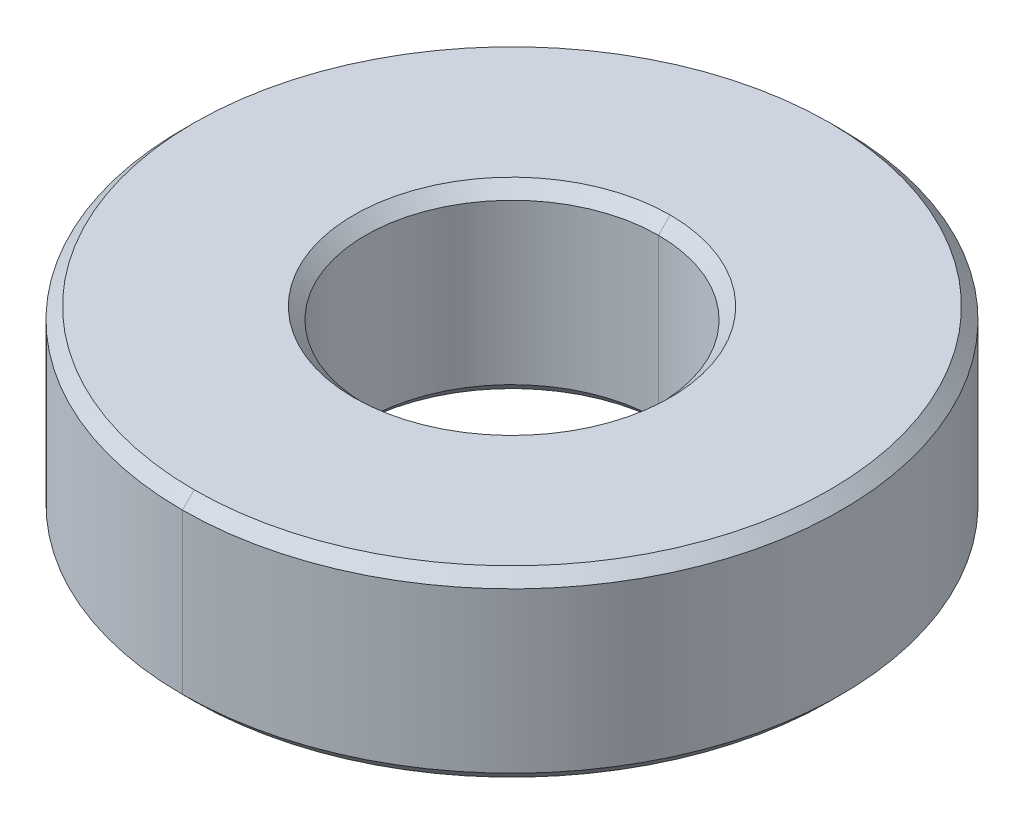
ISO-10303-21;
HEADER;
FILE_DESCRIPTION(('STEP AP214'),'2;1');
FILE_NAME('part.step','',(''),(''),'','','');
FILE_SCHEMA(('AUTOMOTIVE_DESIGN { 1 0 10303 214 1 1 1 1 }'));
ENDSEC;
DATA;
#1=APPLICATION_CONTEXT('core data for automotive mechanical design processes');
#2=APPLICATION_PROTOCOL_DEFINITION('international standard','automotive_design',2000,#1);
#3=PRODUCT_CONTEXT('',#1,'mechanical');
#4=PRODUCT('Part','Part','',(#3));
#5=PRODUCT_RELATED_PRODUCT_CATEGORY('part','',(#4));
#6=PRODUCT_DEFINITION_FORMATION('','',#4);
#7=PRODUCT_DEFINITION_CONTEXT('part definition',#1,'design');
#8=PRODUCT_DEFINITION('design','',#6,#7);
#9=PRODUCT_DEFINITION_SHAPE('','',#8);
#10=(LENGTH_UNIT() NAMED_UNIT(*) SI_UNIT(.MILLI.,.METRE.));
#11=(NAMED_UNIT(*) PLANE_ANGLE_UNIT() SI_UNIT($,.RADIAN.));
#12=(NAMED_UNIT(*) SI_UNIT($,.STERADIAN.) SOLID_ANGLE_UNIT());
#13=UNCERTAINTY_MEASURE_WITH_UNIT(LENGTH_MEASURE(1.E-05),#10,'distance_accuracy_value','');
#14=(GEOMETRIC_REPRESENTATION_CONTEXT(3) GLOBAL_UNCERTAINTY_ASSIGNED_CONTEXT((#13)) GLOBAL_UNIT_ASSIGNED_CONTEXT((#10,
#11,#12)) REPRESENTATION_CONTEXT('',''));
#15=CARTESIAN_POINT('',(0.,0.,0.));
#16=DIRECTION('',(0.,0.,1.));
#17=DIRECTION('',(1.,0.,0.));
#18=AXIS2_PLACEMENT_3D('',#15,#16,#17);
#19=CARTESIAN_POINT('',(0.,3.96875,0.));
#20=DIRECTION('',(0.,-1.,0.));
#21=DIRECTION('',(0.,0.,-1.));
#22=AXIS2_PLACEMENT_3D('',#19,#20,#21);
#23=CONICAL_SURFACE('',#22,13.7795,0.785398163397442);
#24=DIRECTION('',(0.,-0.707106781186552,0.707106781186543));
#25=VECTOR('',#24,1.);
#26=CARTESIAN_POINT('',(0.,3.96875,13.7795));
#27=LINE('',#26,#25);
#28=CARTESIAN_POINT('',(0.,3.96875,13.7795));
#29=VERTEX_POINT('',#28);
#30=CARTESIAN_POINT('',(0.,3.46075,14.2875));
#31=VERTEX_POINT('',#30);
#32=EDGE_CURVE('E125',#29,#31,#27,.T.);
#33=ORIENTED_EDGE('',*,*,#32,.F.);
#34=CARTESIAN_POINT('',(0.,3.96875,0.));
#35=DIRECTION('',(0.,1.,0.));
#36=DIRECTION('',(0.,0.,1.));
#37=AXIS2_PLACEMENT_3D('',#34,#35,#36);
#38=CIRCLE('',#37,13.7795);
#39=CARTESIAN_POINT('',(0.,3.96875,-13.7795));
#40=VERTEX_POINT('',#39);
#41=EDGE_CURVE('E100',#40,#29,#38,.T.);
#42=ORIENTED_EDGE('',*,*,#41,.F.);
#43=DIRECTION('',(0.,-0.707106781186552,-0.707106781186543));
#44=VECTOR('',#43,1.);
#45=CARTESIAN_POINT('',(0.,3.96875,-13.7795));
#46=LINE('',#45,#44);
#47=CARTESIAN_POINT('',(0.,3.46075,-14.2875));
#48=VERTEX_POINT('',#47);
#49=EDGE_CURVE('E141',#40,#48,#46,.T.);
#50=ORIENTED_EDGE('',*,*,#49,.T.);
#51=CARTESIAN_POINT('',(0.,3.46075,0.));
#52=DIRECTION('',(0.,-1.,0.));
#53=DIRECTION('',(0.,0.,1.));
#54=AXIS2_PLACEMENT_3D('',#51,#52,#53);
#55=CIRCLE('',#54,14.2875);
#56=EDGE_CURVE('E153',#31,#48,#55,.T.);
#57=ORIENTED_EDGE('',*,*,#56,.F.);
#58=EDGE_LOOP('',(#33,#42,#50,#57));
#59=FACE_BOUND('',#58,.T.);
#60=ADVANCED_FACE('F16',(#59),#23,.T.);
#61=CARTESIAN_POINT('',(0.,3.46075,0.));
#62=DIRECTION('',(0.,1.,0.));
#63=DIRECTION('',(0.,0.,1.));
#64=AXIS2_PLACEMENT_3D('',#61,#62,#63);
#65=CONICAL_SURFACE('',#64,6.35,0.78539816339745);
#66=DIRECTION('',(0.,0.707106781186546,-0.707106781186549));
#67=VECTOR('',#66,1.);
#68=CARTESIAN_POINT('',(0.,3.46075,-6.35));
#69=LINE('',#68,#67);
#70=CARTESIAN_POINT('',(0.,3.46075,-6.35));
#71=VERTEX_POINT('',#70);
#72=CARTESIAN_POINT('',(0.,3.96875,-6.858));
#73=VERTEX_POINT('',#72);
#74=EDGE_CURVE('E114',#71,#73,#69,.T.);
#75=ORIENTED_EDGE('',*,*,#74,.F.);
#76=CARTESIAN_POINT('',(0.,3.46075,0.));
#77=DIRECTION('',(0.,1.,0.));
#78=DIRECTION('',(0.,0.,1.));
#79=AXIS2_PLACEMENT_3D('',#76,#77,#78);
#80=CIRCLE('',#79,6.35);
#81=CARTESIAN_POINT('',(0.,3.46075,6.35));
#82=VERTEX_POINT('',#81);
#83=EDGE_CURVE('E26',#82,#71,#80,.T.);
#84=ORIENTED_EDGE('',*,*,#83,.F.);
#85=DIRECTION('',(0.,0.707106781186546,0.707106781186549));
#86=VECTOR('',#85,1.);
#87=CARTESIAN_POINT('',(0.,3.46075,6.35));
#88=LINE('',#87,#86);
#89=CARTESIAN_POINT('',(0.,3.96875,6.858));
#90=VERTEX_POINT('',#89);
#91=EDGE_CURVE('E103',#82,#90,#88,.T.);
#92=ORIENTED_EDGE('',*,*,#91,.T.);
#93=CARTESIAN_POINT('',(0.,3.96875,0.));
#94=DIRECTION('',(0.,-1.,0.));
#95=DIRECTION('',(0.,0.,1.));
#96=AXIS2_PLACEMENT_3D('',#93,#94,#95);
#97=CIRCLE('',#96,6.858);
#98=EDGE_CURVE('E89',#73,#90,#97,.T.);
#99=ORIENTED_EDGE('',*,*,#98,.F.);
#100=EDGE_LOOP('',(#75,#84,#92,#99));
#101=FACE_BOUND('',#100,.T.);
#102=ADVANCED_FACE('F104',(#101),#65,.F.);
#103=CARTESIAN_POINT('',(0.,-3.46075,0.));
#104=DIRECTION('',(0.,1.,0.));
#105=DIRECTION('',(0.,0.,1.));
#106=AXIS2_PLACEMENT_3D('',#103,#104,#105);
#107=CONICAL_SURFACE('',#106,14.2875,0.78539816339745);
#108=DIRECTION('',(0.,0.707106781186546,-0.707106781186549));
#109=VECTOR('',#108,1.);
#110=CARTESIAN_POINT('',(0.,-3.46075,-14.2875));
#111=LINE('',#110,#109);
#112=CARTESIAN_POINT('',(0.,-3.96875,-13.7795));
#113=VERTEX_POINT('',#112);
#114=CARTESIAN_POINT('',(0.,-3.46075,-14.2875));
#115=VERTEX_POINT('',#114);
#116=EDGE_CURVE('E176',#113,#115,#111,.T.);
#117=ORIENTED_EDGE('',*,*,#116,.F.);
#118=CARTESIAN_POINT('',(0.,-3.96875,0.));
#119=DIRECTION('',(0.,-1.,0.));
#120=DIRECTION('',(0.,0.,1.));
#121=AXIS2_PLACEMENT_3D('',#118,#119,#120);
#122=CIRCLE('',#121,13.7795);
#123=CARTESIAN_POINT('',(0.,-3.96875,13.7795));
#124=VERTEX_POINT('',#123);
#125=EDGE_CURVE('E99',#124,#113,#122,.T.);
#126=ORIENTED_EDGE('',*,*,#125,.F.);
#127=DIRECTION('',(0.,0.707106781186546,0.707106781186549));
#128=VECTOR('',#127,1.);
#129=CARTESIAN_POINT('',(0.,-3.46075,14.2875));
#130=LINE('',#129,#128);
#131=CARTESIAN_POINT('',(0.,-3.46075,14.2875));
#132=VERTEX_POINT('',#131);
#133=EDGE_CURVE('E175',#124,#132,#130,.T.);
#134=ORIENTED_EDGE('',*,*,#133,.T.);
#135=CARTESIAN_POINT('',(0.,-3.46075,0.));
#136=DIRECTION('',(0.,1.,0.));
#137=DIRECTION('',(0.,0.,1.));
#138=AXIS2_PLACEMENT_3D('',#135,#136,#137);
#139=CIRCLE('',#138,14.2875);
#140=EDGE_CURVE('E147',#115,#132,#139,.T.);
#141=ORIENTED_EDGE('',*,*,#140,.F.);
#142=EDGE_LOOP('',(#117,#126,#134,#141));
#143=FACE_BOUND('',#142,.T.);
#144=ADVANCED_FACE('F213',(#143),#107,.T.);
#145=CARTESIAN_POINT('',(0.,-3.96875,0.));
#146=DIRECTION('',(0.,-1.,0.));
#147=DIRECTION('',(0.,0.,-1.));
#148=AXIS2_PLACEMENT_3D('',#145,#146,#147);
#149=CONICAL_SURFACE('',#148,6.858,0.785398163397446);
#150=DIRECTION('',(0.,-0.707106781186549,0.707106781186546));
#151=VECTOR('',#150,1.);
#152=CARTESIAN_POINT('',(0.,-3.96875,6.858));
#153=LINE('',#152,#151);
#154=CARTESIAN_POINT('',(0.,-3.46075,6.35));
#155=VERTEX_POINT('',#154);
#156=CARTESIAN_POINT('',(0.,-3.96875,6.858));
#157=VERTEX_POINT('',#156);
#158=EDGE_CURVE('E131',#155,#157,#153,.T.);
#159=ORIENTED_EDGE('',*,*,#158,.F.);
#160=CARTESIAN_POINT('',(0.,-3.46075,0.));
#161=DIRECTION('',(0.,-1.,0.));
#162=DIRECTION('',(0.,0.,1.));
#163=AXIS2_PLACEMENT_3D('',#160,#161,#162);
#164=CIRCLE('',#163,6.35);
#165=CARTESIAN_POINT('',(0.,-3.46075,-6.35));
#166=VERTEX_POINT('',#165);
#167=EDGE_CURVE('E11',#166,#155,#164,.T.);
#168=ORIENTED_EDGE('',*,*,#167,.F.);
#169=DIRECTION('',(0.,-0.707106781186549,-0.707106781186546));
#170=VECTOR('',#169,1.);
#171=CARTESIAN_POINT('',(0.,-3.96875,-6.858));
#172=LINE('',#171,#170);
#173=CARTESIAN_POINT('',(0.,-3.96875,-6.858));
#174=VERTEX_POINT('',#173);
#175=EDGE_CURVE('E130',#166,#174,#172,.T.);
#176=ORIENTED_EDGE('',*,*,#175,.T.);
#177=CARTESIAN_POINT('',(0.,-3.96875,0.));
#178=DIRECTION('',(0.,1.,0.));
#179=DIRECTION('',(0.,0.,1.));
#180=AXIS2_PLACEMENT_3D('',#177,#178,#179);
#181=CIRCLE('',#180,6.858);
#182=EDGE_CURVE('E20',#157,#174,#181,.T.);
#183=ORIENTED_EDGE('',*,*,#182,.F.);
#184=EDGE_LOOP('',(#159,#168,#176,#183));
#185=FACE_BOUND('',#184,.T.);
#186=ADVANCED_FACE('F211',(#185),#149,.F.);
#187=CARTESIAN_POINT('',(0.,3.96875,0.));
#188=DIRECTION('',(0.,-1.,0.));
#189=DIRECTION('',(0.,0.,-1.));
#190=AXIS2_PLACEMENT_3D('',#187,#188,#189);
#191=CYLINDRICAL_SURFACE('',#190,6.35);
#192=DIRECTION('',(0.,-1.,0.));
#193=VECTOR('',#192,1.);
#194=CARTESIAN_POINT('',(0.,3.96875,6.35));
#195=LINE('',#194,#193);
#196=EDGE_CURVE('E136',#82,#155,#195,.T.);
#197=ORIENTED_EDGE('',*,*,#196,.F.);
#198=ORIENTED_EDGE('',*,*,#83,.T.);
#199=DIRECTION('',(0.,-1.,0.));
#200=VECTOR('',#199,1.);
#201=CARTESIAN_POINT('',(0.,3.96875,-6.35));
#202=LINE('',#201,#200);
#203=EDGE_CURVE('E140',#71,#166,#202,.T.);
#204=ORIENTED_EDGE('',*,*,#203,.T.);
#205=ORIENTED_EDGE('',*,*,#167,.T.);
#206=EDGE_LOOP('',(#197,#198,#204,#205));
#207=FACE_BOUND('',#206,.T.);
#208=ADVANCED_FACE('F209',(#207),#191,.F.);
#209=CARTESIAN_POINT('',(0.,3.96875,0.));
#210=DIRECTION('',(0.,-1.,0.));
#211=DIRECTION('',(0.,0.,-1.));
#212=AXIS2_PLACEMENT_3D('',#209,#210,#211);
#213=CYLINDRICAL_SURFACE('',#212,14.2875);
#214=DIRECTION('',(0.,-1.,0.));
#215=VECTOR('',#214,1.);
#216=CARTESIAN_POINT('',(0.,3.96875,14.2875));
#217=LINE('',#216,#215);
#218=EDGE_CURVE('E161',#31,#132,#217,.T.);
#219=ORIENTED_EDGE('',*,*,#218,.F.);
#220=ORIENTED_EDGE('',*,*,#56,.T.);
#221=DIRECTION('',(0.,-1.,0.));
#222=VECTOR('',#221,1.);
#223=CARTESIAN_POINT('',(0.,3.96875,-14.2875));
#224=LINE('',#223,#222);
#225=EDGE_CURVE('E157',#48,#115,#224,.T.);
#226=ORIENTED_EDGE('',*,*,#225,.T.);
#227=ORIENTED_EDGE('',*,*,#140,.T.);
#228=EDGE_LOOP('',(#219,#220,#226,#227));
#229=FACE_BOUND('',#228,.T.);
#230=ADVANCED_FACE('F220',(#229),#213,.T.);
#231=CARTESIAN_POINT('',(0.,-3.96875,0.));
#232=DIRECTION('',(0.,1.,0.));
#233=DIRECTION('',(1.,0.,0.));
#234=AXIS2_PLACEMENT_3D('',#231,#232,#233);
#235=PLANE('',#234);
#236=CARTESIAN_POINT('',(0.,-3.96875,0.));
#237=DIRECTION('',(0.,1.,0.));
#238=DIRECTION('',(0.,0.,1.));
#239=AXIS2_PLACEMENT_3D('',#236,#237,#238);
#240=CIRCLE('',#239,6.858);
#241=EDGE_CURVE('E127',#174,#157,#240,.T.);
#242=ORIENTED_EDGE('',*,*,#241,.T.);
#243=ORIENTED_EDGE('',*,*,#182,.T.);
#244=EDGE_LOOP('',(#242,#243));
#245=FACE_BOUND('',#244,.T.);
#246=ORIENTED_EDGE('',*,*,#125,.T.);
#247=CARTESIAN_POINT('',(0.,-3.96875,0.));
#248=DIRECTION('',(0.,-1.,0.));
#249=DIRECTION('',(0.,0.,1.));
#250=AXIS2_PLACEMENT_3D('',#247,#248,#249);
#251=CIRCLE('',#250,13.7795);
#252=EDGE_CURVE('E111',#113,#124,#251,.T.);
#253=ORIENTED_EDGE('',*,*,#252,.T.);
#254=EDGE_LOOP('',(#246,#253));
#255=FACE_BOUND('',#254,.T.);
#256=ADVANCED_FACE('F236',(#245,#255),#235,.F.);
#257=CARTESIAN_POINT('',(0.,3.96875,0.));
#258=DIRECTION('',(0.,1.,0.));
#259=DIRECTION('',(1.,0.,0.));
#260=AXIS2_PLACEMENT_3D('',#257,#258,#259);
#261=PLANE('',#260);
#262=CARTESIAN_POINT('',(0.,3.96875,0.));
#263=DIRECTION('',(0.,-1.,0.));
#264=DIRECTION('',(0.,0.,1.));
#265=AXIS2_PLACEMENT_3D('',#262,#263,#264);
#266=CIRCLE('',#265,6.858);
#267=EDGE_CURVE('E94',#90,#73,#266,.T.);
#268=ORIENTED_EDGE('',*,*,#267,.T.);
#269=ORIENTED_EDGE('',*,*,#98,.T.);
#270=EDGE_LOOP('',(#268,#269));
#271=FACE_BOUND('',#270,.T.);
#272=ORIENTED_EDGE('',*,*,#41,.T.);
#273=CARTESIAN_POINT('',(0.,3.96875,0.));
#274=DIRECTION('',(0.,1.,0.));
#275=DIRECTION('',(0.,0.,1.));
#276=AXIS2_PLACEMENT_3D('',#273,#274,#275);
#277=CIRCLE('',#276,13.7795);
#278=EDGE_CURVE('E132',#29,#40,#277,.T.);
#279=ORIENTED_EDGE('',*,*,#278,.T.);
#280=EDGE_LOOP('',(#272,#279));
#281=FACE_BOUND('',#280,.T.);
#282=ADVANCED_FACE('F91',(#271,#281),#261,.T.);
#283=CARTESIAN_POINT('',(0.,3.96875,0.));
#284=DIRECTION('',(0.,-1.,0.));
#285=DIRECTION('',(0.,0.,-1.));
#286=AXIS2_PLACEMENT_3D('',#283,#284,#285);
#287=CYLINDRICAL_SURFACE('',#286,14.2875);
#288=CARTESIAN_POINT('',(0.,3.46075,0.));
#289=DIRECTION('',(0.,-1.,0.));
#290=DIRECTION('',(0.,0.,1.));
#291=AXIS2_PLACEMENT_3D('',#288,#289,#290);
#292=CIRCLE('',#291,14.2875);
#293=EDGE_CURVE('E144',#48,#31,#292,.T.);
#294=ORIENTED_EDGE('',*,*,#293,.T.);
#295=ORIENTED_EDGE('',*,*,#218,.T.);
#296=CARTESIAN_POINT('',(0.,-3.46075,0.));
#297=DIRECTION('',(0.,1.,0.));
#298=DIRECTION('',(0.,0.,1.));
#299=AXIS2_PLACEMENT_3D('',#296,#297,#298);
#300=CIRCLE('',#299,14.2875);
#301=EDGE_CURVE('E171',#132,#115,#300,.T.);
#302=ORIENTED_EDGE('',*,*,#301,.T.);
#303=ORIENTED_EDGE('',*,*,#225,.F.);
#304=EDGE_LOOP('',(#294,#295,#302,#303));
#305=FACE_BOUND('',#304,.T.);
#306=ADVANCED_FACE('F235',(#305),#287,.T.);
#307=CARTESIAN_POINT('',(0.,3.96875,0.));
#308=DIRECTION('',(0.,-1.,0.));
#309=DIRECTION('',(0.,0.,-1.));
#310=AXIS2_PLACEMENT_3D('',#307,#308,#309);
#311=CYLINDRICAL_SURFACE('',#310,6.35);
#312=CARTESIAN_POINT('',(0.,3.46075,0.));
#313=DIRECTION('',(0.,1.,0.));
#314=DIRECTION('',(0.,0.,1.));
#315=AXIS2_PLACEMENT_3D('',#312,#313,#314);
#316=CIRCLE('',#315,6.35);
#317=EDGE_CURVE('E121',#71,#82,#316,.T.);
#318=ORIENTED_EDGE('',*,*,#317,.T.);
#319=ORIENTED_EDGE('',*,*,#196,.T.);
#320=CARTESIAN_POINT('',(0.,-3.46075,0.));
#321=DIRECTION('',(0.,-1.,0.));
#322=DIRECTION('',(0.,0.,1.));
#323=AXIS2_PLACEMENT_3D('',#320,#321,#322);
#324=CIRCLE('',#323,6.35);
#325=EDGE_CURVE('E187',#155,#166,#324,.T.);
#326=ORIENTED_EDGE('',*,*,#325,.T.);
#327=ORIENTED_EDGE('',*,*,#203,.F.);
#328=EDGE_LOOP('',(#318,#319,#326,#327));
#329=FACE_BOUND('',#328,.T.);
#330=ADVANCED_FACE('F239',(#329),#311,.F.);
#331=CARTESIAN_POINT('',(0.,-3.96875,0.));
#332=DIRECTION('',(0.,-1.,0.));
#333=DIRECTION('',(0.,0.,-1.));
#334=AXIS2_PLACEMENT_3D('',#331,#332,#333);
#335=CONICAL_SURFACE('',#334,6.858,0.785398163397446);
#336=ORIENTED_EDGE('',*,*,#325,.F.);
#337=ORIENTED_EDGE('',*,*,#158,.T.);
#338=ORIENTED_EDGE('',*,*,#241,.F.);
#339=ORIENTED_EDGE('',*,*,#175,.F.);
#340=EDGE_LOOP('',(#336,#337,#338,#339));
#341=FACE_BOUND('',#340,.T.);
#342=ADVANCED_FACE('F210',(#341),#335,.F.);
#343=CARTESIAN_POINT('',(0.,-3.46075,0.));
#344=DIRECTION('',(0.,1.,0.));
#345=DIRECTION('',(0.,0.,1.));
#346=AXIS2_PLACEMENT_3D('',#343,#344,#345);
#347=CONICAL_SURFACE('',#346,14.2875,0.78539816339745);
#348=ORIENTED_EDGE('',*,*,#252,.F.);
#349=ORIENTED_EDGE('',*,*,#116,.T.);
#350=ORIENTED_EDGE('',*,*,#301,.F.);
#351=ORIENTED_EDGE('',*,*,#133,.F.);
#352=EDGE_LOOP('',(#348,#349,#350,#351));
#353=FACE_BOUND('',#352,.T.);
#354=ADVANCED_FACE('F238',(#353),#347,.T.);
#355=CARTESIAN_POINT('',(0.,3.46075,0.));
#356=DIRECTION('',(0.,1.,0.));
#357=DIRECTION('',(0.,0.,1.));
#358=AXIS2_PLACEMENT_3D('',#355,#356,#357);
#359=CONICAL_SURFACE('',#358,6.35,0.78539816339745);
#360=ORIENTED_EDGE('',*,*,#317,.F.);
#361=ORIENTED_EDGE('',*,*,#74,.T.);
#362=ORIENTED_EDGE('',*,*,#267,.F.);
#363=ORIENTED_EDGE('',*,*,#91,.F.);
#364=EDGE_LOOP('',(#360,#361,#362,#363));
#365=FACE_BOUND('',#364,.T.);
#366=ADVANCED_FACE('F113',(#365),#359,.F.);
#367=CARTESIAN_POINT('',(0.,3.96875,0.));
#368=DIRECTION('',(0.,-1.,0.));
#369=DIRECTION('',(0.,0.,-1.));
#370=AXIS2_PLACEMENT_3D('',#367,#368,#369);
#371=CONICAL_SURFACE('',#370,13.7795,0.785398163397442);
#372=ORIENTED_EDGE('',*,*,#278,.F.);
#373=ORIENTED_EDGE('',*,*,#32,.T.);
#374=ORIENTED_EDGE('',*,*,#293,.F.);
#375=ORIENTED_EDGE('',*,*,#49,.F.);
#376=EDGE_LOOP('',(#372,#373,#374,#375));
#377=FACE_BOUND('',#376,.T.);
#378=ADVANCED_FACE('F18',(#377),#371,.T.);
#379=CLOSED_SHELL('',(#60,#102,#144,#186,#208,#230,#256,#282,#306,#330,#342,#354,#366,#378));
#380=MANIFOLD_SOLID_BREP('B1',#379);
#381=ADVANCED_BREP_SHAPE_REPRESENTATION('',(#18,#380),#14);
#382=SHAPE_DEFINITION_REPRESENTATION(#9,#381);
ENDSEC;
END-ISO-10303-21;
